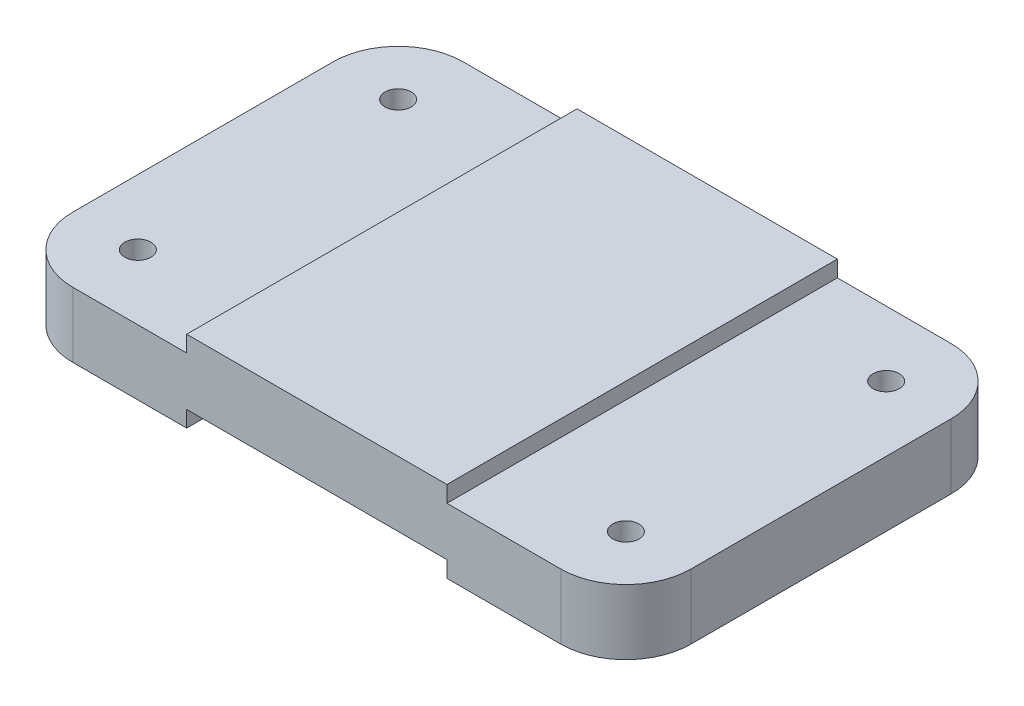
ISO-10303-21;
HEADER;
FILE_DESCRIPTION(('STEP AP214'),'2;1');
FILE_NAME('part.step','',(''),(''),'','','');
FILE_SCHEMA(('AUTOMOTIVE_DESIGN { 1 0 10303 214 1 1 1 1 }'));
ENDSEC;
DATA;
#1=APPLICATION_CONTEXT('core data for automotive mechanical design processes');
#2=APPLICATION_PROTOCOL_DEFINITION('international standard','automotive_design',2000,#1);
#3=PRODUCT_CONTEXT('',#1,'mechanical');
#4=PRODUCT('Part','Part','',(#3));
#5=PRODUCT_RELATED_PRODUCT_CATEGORY('part','',(#4));
#6=PRODUCT_DEFINITION_FORMATION('','',#4);
#7=PRODUCT_DEFINITION_CONTEXT('part definition',#1,'design');
#8=PRODUCT_DEFINITION('design','',#6,#7);
#9=PRODUCT_DEFINITION_SHAPE('','',#8);
#10=(LENGTH_UNIT() NAMED_UNIT(*) SI_UNIT(.MILLI.,.METRE.));
#11=(NAMED_UNIT(*) PLANE_ANGLE_UNIT() SI_UNIT($,.RADIAN.));
#12=(NAMED_UNIT(*) SI_UNIT($,.STERADIAN.) SOLID_ANGLE_UNIT());
#13=UNCERTAINTY_MEASURE_WITH_UNIT(LENGTH_MEASURE(1.E-05),#10,'distance_accuracy_value','');
#14=(GEOMETRIC_REPRESENTATION_CONTEXT(3) GLOBAL_UNCERTAINTY_ASSIGNED_CONTEXT((#13)) GLOBAL_UNIT_ASSIGNED_CONTEXT((#10,
#11,#12)) REPRESENTATION_CONTEXT('',''));
#15=CARTESIAN_POINT('',(0.,0.,0.));
#16=DIRECTION('',(0.,0.,1.));
#17=DIRECTION('',(1.,0.,0.));
#18=AXIS2_PLACEMENT_3D('',#15,#16,#17);
#19=CARTESIAN_POINT('',(-3.38666666666671,12.7,-76.2));
#20=DIRECTION('',(-1.,0.,0.));
#21=DIRECTION('',(0.,-1.,0.));
#22=AXIS2_PLACEMENT_3D('',#19,#20,#21);
#23=PLANE('',#22);
#24=DIRECTION('',(0.,0.,1.));
#25=VECTOR('',#24,1.);
#26=CARTESIAN_POINT('',(-3.38666666666671,12.7,-76.2));
#27=LINE('',#26,#25);
#28=CARTESIAN_POINT('',(-3.38666666666671,12.7,-63.5));
#29=VERTEX_POINT('',#28);
#30=CARTESIAN_POINT('',(-3.38666666666671,12.7,-12.7));
#31=VERTEX_POINT('',#30);
#32=EDGE_CURVE('E228',#29,#31,#27,.T.);
#33=ORIENTED_EDGE('',*,*,#32,.F.);
#34=DIRECTION('',(0.,-1.,0.));
#35=VECTOR('',#34,1.);
#36=CARTESIAN_POINT('',(-3.38666666666671,0.,-63.5));
#37=LINE('',#36,#35);
#38=CARTESIAN_POINT('',(-3.38666666666671,0.,-63.5));
#39=VERTEX_POINT('',#38);
#40=EDGE_CURVE('E271',#29,#39,#37,.T.);
#41=ORIENTED_EDGE('',*,*,#40,.T.);
#42=DIRECTION('',(0.,0.,1.));
#43=VECTOR('',#42,1.);
#44=CARTESIAN_POINT('',(-3.38666666666671,0.,-76.2));
#45=LINE('',#44,#43);
#46=CARTESIAN_POINT('',(-3.38666666666671,0.,-12.7));
#47=VERTEX_POINT('',#46);
#48=EDGE_CURVE('E171',#39,#47,#45,.T.);
#49=ORIENTED_EDGE('',*,*,#48,.T.);
#50=DIRECTION('',(0.,-1.,0.));
#51=VECTOR('',#50,1.);
#52=CARTESIAN_POINT('',(-3.38666666666671,12.7,-12.7));
#53=LINE('',#52,#51);
#54=EDGE_CURVE('E269',#47,#31,#53,.F.);
#55=ORIENTED_EDGE('',*,*,#54,.T.);
#56=EDGE_LOOP('',(#33,#41,#49,#55));
#57=FACE_BOUND('',#56,.T.);
#58=ADVANCED_FACE('F35',(#57),#23,.T.);
#59=CARTESIAN_POINT('',(31.5383333333333,12.7,-76.2));
#60=DIRECTION('',(0.,1.,0.));
#61=DIRECTION('',(-1.,0.,0.));
#62=AXIS2_PLACEMENT_3D('',#59,#60,#61);
#63=PLANE('',#62);
#64=CARTESIAN_POINT('',(9.31333333333333,12.7,-12.7));
#65=DIRECTION('',(0.,1.,0.));
#66=DIRECTION('',(0.,0.,1.));
#67=AXIS2_PLACEMENT_3D('',#64,#65,#66);
#68=CIRCLE('',#67,2.55269999999999);
#69=CARTESIAN_POINT('',(9.31333333333333,12.7,-10.1473));
#70=VERTEX_POINT('',#69);
#71=EDGE_CURVE('E401',#70,#70,#68,.T.);
#72=ORIENTED_EDGE('',*,*,#71,.F.);
#73=EDGE_LOOP('',(#72));
#74=FACE_BOUND('',#73,.T.);
#75=CARTESIAN_POINT('',(9.31333333333333,12.7,-63.5));
#76=DIRECTION('',(0.,1.,0.));
#77=DIRECTION('',(0.,0.,1.));
#78=AXIS2_PLACEMENT_3D('',#75,#76,#77);
#79=CIRCLE('',#78,2.55269999999999);
#80=CARTESIAN_POINT('',(9.31333333333333,12.7,-60.9473));
#81=VERTEX_POINT('',#80);
#82=EDGE_CURVE('E407',#81,#81,#79,.T.);
#83=ORIENTED_EDGE('',*,*,#82,.F.);
#84=EDGE_LOOP('',(#83));
#85=FACE_BOUND('',#84,.T.);
#86=DIRECTION('',(-1.,0.,0.));
#87=VECTOR('',#86,1.);
#88=CARTESIAN_POINT('',(31.5383333333333,12.7,-76.2));
#89=LINE('',#88,#87);
#90=CARTESIAN_POINT('',(31.5383333333333,12.7,-76.2));
#91=VERTEX_POINT('',#90);
#92=CARTESIAN_POINT('',(9.31333333333328,12.7,-76.2));
#93=VERTEX_POINT('',#92);
#94=EDGE_CURVE('E200',#91,#93,#89,.T.);
#95=ORIENTED_EDGE('',*,*,#94,.T.);
#96=CARTESIAN_POINT('',(9.31333333333329,12.7,-63.5));
#97=DIRECTION('',(0.,1.,0.));
#98=DIRECTION('',(-1.,0.,0.));
#99=AXIS2_PLACEMENT_3D('',#96,#97,#98);
#100=CIRCLE('',#99,12.7);
#101=EDGE_CURVE('E277',#93,#29,#100,.T.);
#102=ORIENTED_EDGE('',*,*,#101,.T.);
#103=ORIENTED_EDGE('',*,*,#32,.T.);
#104=CARTESIAN_POINT('',(9.31333333333329,12.7,-12.7));
#105=DIRECTION('',(0.,1.,0.));
#106=DIRECTION('',(-1.,0.,0.));
#107=AXIS2_PLACEMENT_3D('',#104,#105,#106);
#108=CIRCLE('',#107,12.7);
#109=CARTESIAN_POINT('',(9.31333333333328,12.7,0.));
#110=VERTEX_POINT('',#109);
#111=EDGE_CURVE('E51',#31,#110,#108,.T.);
#112=ORIENTED_EDGE('',*,*,#111,.T.);
#113=DIRECTION('',(-1.,0.,0.));
#114=VECTOR('',#113,1.);
#115=CARTESIAN_POINT('',(31.5383333333333,12.7,0.));
#116=LINE('',#115,#114);
#117=CARTESIAN_POINT('',(31.5383333333333,12.7,0.));
#118=VERTEX_POINT('',#117);
#119=EDGE_CURVE('E163',#118,#110,#116,.T.);
#120=ORIENTED_EDGE('',*,*,#119,.F.);
#121=DIRECTION('',(0.,0.,1.));
#122=VECTOR('',#121,1.);
#123=CARTESIAN_POINT('',(31.5383333333333,12.7,-76.2));
#124=LINE('',#123,#122);
#125=EDGE_CURVE('E231',#91,#118,#124,.T.);
#126=ORIENTED_EDGE('',*,*,#125,.F.);
#127=EDGE_LOOP('',(#95,#102,#103,#112,#120,#126));
#128=FACE_BOUND('',#127,.T.);
#129=ADVANCED_FACE('F304',(#74,#85,#128),#63,.T.);
#130=CARTESIAN_POINT('',(31.5383333333333,15.875,-76.2));
#131=DIRECTION('',(-1.,0.,0.));
#132=DIRECTION('',(0.,0.,1.));
#133=AXIS2_PLACEMENT_3D('',#130,#131,#132);
#134=PLANE('',#133);
#135=DIRECTION('',(0.,-1.,0.));
#136=VECTOR('',#135,1.);
#137=CARTESIAN_POINT('',(31.5383333333333,15.875,0.));
#138=LINE('',#137,#136);
#139=CARTESIAN_POINT('',(31.5383333333333,15.875,0.));
#140=VERTEX_POINT('',#139);
#141=EDGE_CURVE('E224',#140,#118,#138,.T.);
#142=ORIENTED_EDGE('',*,*,#141,.F.);
#143=DIRECTION('',(0.,0.,1.));
#144=VECTOR('',#143,1.);
#145=CARTESIAN_POINT('',(31.5383333333333,15.875,-76.2));
#146=LINE('',#145,#144);
#147=CARTESIAN_POINT('',(31.5383333333333,15.875,-76.2));
#148=VERTEX_POINT('',#147);
#149=EDGE_CURVE('E233',#148,#140,#146,.T.);
#150=ORIENTED_EDGE('',*,*,#149,.F.);
#151=DIRECTION('',(0.,-1.,0.));
#152=VECTOR('',#151,1.);
#153=CARTESIAN_POINT('',(31.5383333333333,15.875,-76.2));
#154=LINE('',#153,#152);
#155=EDGE_CURVE('E197',#148,#91,#154,.T.);
#156=ORIENTED_EDGE('',*,*,#155,.T.);
#157=ORIENTED_EDGE('',*,*,#125,.T.);
#158=EDGE_LOOP('',(#142,#150,#156,#157));
#159=FACE_BOUND('',#158,.T.);
#160=ADVANCED_FACE('F302',(#159),#134,.T.);
#161=CARTESIAN_POINT('',(82.3383333333333,15.875,-76.2));
#162=DIRECTION('',(0.,1.,0.));
#163=DIRECTION('',(-1.,0.,0.));
#164=AXIS2_PLACEMENT_3D('',#161,#162,#163);
#165=PLANE('',#164);
#166=DIRECTION('',(-1.,0.,0.));
#167=VECTOR('',#166,1.);
#168=CARTESIAN_POINT('',(82.3383333333333,15.875,0.));
#169=LINE('',#168,#167);
#170=CARTESIAN_POINT('',(82.3383333333333,15.875,0.));
#171=VERTEX_POINT('',#170);
#172=EDGE_CURVE('E221',#171,#140,#169,.T.);
#173=ORIENTED_EDGE('',*,*,#172,.F.);
#174=DIRECTION('',(0.,0.,1.));
#175=VECTOR('',#174,1.);
#176=CARTESIAN_POINT('',(82.3383333333333,15.875,-76.2));
#177=LINE('',#176,#175);
#178=CARTESIAN_POINT('',(82.3383333333333,15.875,-76.2));
#179=VERTEX_POINT('',#178);
#180=EDGE_CURVE('E235',#179,#171,#177,.T.);
#181=ORIENTED_EDGE('',*,*,#180,.F.);
#182=DIRECTION('',(-1.,0.,0.));
#183=VECTOR('',#182,1.);
#184=CARTESIAN_POINT('',(82.3383333333333,15.875,-76.2));
#185=LINE('',#184,#183);
#186=EDGE_CURVE('E194',#179,#148,#185,.T.);
#187=ORIENTED_EDGE('',*,*,#186,.T.);
#188=ORIENTED_EDGE('',*,*,#149,.T.);
#189=EDGE_LOOP('',(#173,#181,#187,#188));
#190=FACE_BOUND('',#189,.T.);
#191=ADVANCED_FACE('F298',(#190),#165,.T.);
#192=CARTESIAN_POINT('',(82.3383333333333,12.7,-76.2));
#193=DIRECTION('',(1.,0.,0.));
#194=DIRECTION('',(0.,0.,-1.));
#195=AXIS2_PLACEMENT_3D('',#192,#193,#194);
#196=PLANE('',#195);
#197=DIRECTION('',(0.,1.,0.));
#198=VECTOR('',#197,1.);
#199=CARTESIAN_POINT('',(82.3383333333333,12.7,0.));
#200=LINE('',#199,#198);
#201=CARTESIAN_POINT('',(82.3383333333333,12.7,0.));
#202=VERTEX_POINT('',#201);
#203=EDGE_CURVE('E218',#202,#171,#200,.T.);
#204=ORIENTED_EDGE('',*,*,#203,.F.);
#205=DIRECTION('',(0.,0.,1.));
#206=VECTOR('',#205,1.);
#207=CARTESIAN_POINT('',(82.3383333333333,12.7,-76.2));
#208=LINE('',#207,#206);
#209=CARTESIAN_POINT('',(82.3383333333333,12.7,-76.2));
#210=VERTEX_POINT('',#209);
#211=EDGE_CURVE('E237',#210,#202,#208,.T.);
#212=ORIENTED_EDGE('',*,*,#211,.F.);
#213=DIRECTION('',(0.,1.,0.));
#214=VECTOR('',#213,1.);
#215=CARTESIAN_POINT('',(82.3383333333333,12.7,-76.2));
#216=LINE('',#215,#214);
#217=EDGE_CURVE('E191',#210,#179,#216,.T.);
#218=ORIENTED_EDGE('',*,*,#217,.T.);
#219=ORIENTED_EDGE('',*,*,#180,.T.);
#220=EDGE_LOOP('',(#204,#212,#218,#219));
#221=FACE_BOUND('',#220,.T.);
#222=ADVANCED_FACE('F294',(#221),#196,.T.);
#223=CARTESIAN_POINT('',(117.263333333333,12.7,-76.2));
#224=DIRECTION('',(0.,1.,0.));
#225=DIRECTION('',(-1.,0.,0.));
#226=AXIS2_PLACEMENT_3D('',#223,#224,#225);
#227=PLANE('',#226);
#228=CARTESIAN_POINT('',(104.563333333333,12.7,-63.5));
#229=DIRECTION('',(0.,1.,0.));
#230=DIRECTION('',(0.,0.,1.));
#231=AXIS2_PLACEMENT_3D('',#228,#229,#230);
#232=CIRCLE('',#231,2.55269999999999);
#233=CARTESIAN_POINT('',(104.563333333333,12.7,-60.9473));
#234=VERTEX_POINT('',#233);
#235=EDGE_CURVE('E394',#234,#234,#232,.T.);
#236=ORIENTED_EDGE('',*,*,#235,.F.);
#237=EDGE_LOOP('',(#236));
#238=FACE_BOUND('',#237,.T.);
#239=CARTESIAN_POINT('',(104.563333333333,12.7,-12.7));
#240=DIRECTION('',(0.,1.,0.));
#241=DIRECTION('',(0.,0.,1.));
#242=AXIS2_PLACEMENT_3D('',#239,#240,#241);
#243=CIRCLE('',#242,2.55269999999999);
#244=CARTESIAN_POINT('',(104.563333333333,12.7,-10.1473));
#245=VERTEX_POINT('',#244);
#246=EDGE_CURVE('E396',#245,#245,#243,.T.);
#247=ORIENTED_EDGE('',*,*,#246,.F.);
#248=EDGE_LOOP('',(#247));
#249=FACE_BOUND('',#248,.T.);
#250=DIRECTION('',(0.,0.,1.));
#251=VECTOR('',#250,1.);
#252=CARTESIAN_POINT('',(117.263333333333,12.7,-76.2));
#253=LINE('',#252,#251);
#254=CARTESIAN_POINT('',(117.263333333333,12.7,-63.5));
#255=VERTEX_POINT('',#254);
#256=CARTESIAN_POINT('',(117.263333333333,12.7,-12.7));
#257=VERTEX_POINT('',#256);
#258=EDGE_CURVE('E240',#255,#257,#253,.T.);
#259=ORIENTED_EDGE('',*,*,#258,.F.);
#260=CARTESIAN_POINT('',(104.563333333333,12.7,-63.5));
#261=DIRECTION('',(0.,1.,0.));
#262=DIRECTION('',(-1.,0.,0.));
#263=AXIS2_PLACEMENT_3D('',#260,#261,#262);
#264=CIRCLE('',#263,12.7);
#265=CARTESIAN_POINT('',(104.563333333333,12.7,-76.2));
#266=VERTEX_POINT('',#265);
#267=EDGE_CURVE('E259',#255,#266,#264,.T.);
#268=ORIENTED_EDGE('',*,*,#267,.T.);
#269=DIRECTION('',(-1.,0.,0.));
#270=VECTOR('',#269,1.);
#271=CARTESIAN_POINT('',(117.263333333333,12.7,-76.2));
#272=LINE('',#271,#270);
#273=EDGE_CURVE('E189',#266,#210,#272,.T.);
#274=ORIENTED_EDGE('',*,*,#273,.T.);
#275=ORIENTED_EDGE('',*,*,#211,.T.);
#276=DIRECTION('',(-1.,0.,0.));
#277=VECTOR('',#276,1.);
#278=CARTESIAN_POINT('',(117.263333333333,12.7,0.));
#279=LINE('',#278,#277);
#280=CARTESIAN_POINT('',(104.563333333333,12.7,0.));
#281=VERTEX_POINT('',#280);
#282=EDGE_CURVE('E216',#281,#202,#279,.T.);
#283=ORIENTED_EDGE('',*,*,#282,.F.);
#284=CARTESIAN_POINT('',(104.563333333333,12.7,-12.7));
#285=DIRECTION('',(0.,1.,0.));
#286=DIRECTION('',(-1.,0.,0.));
#287=AXIS2_PLACEMENT_3D('',#284,#285,#286);
#288=CIRCLE('',#287,12.7);
#289=EDGE_CURVE('E257',#281,#257,#288,.T.);
#290=ORIENTED_EDGE('',*,*,#289,.T.);
#291=EDGE_LOOP('',(#259,#268,#274,#275,#283,#290));
#292=FACE_BOUND('',#291,.T.);
#293=ADVANCED_FACE('F289',(#238,#249,#292),#227,.T.);
#294=CARTESIAN_POINT('',(117.263333333333,0.,-76.2));
#295=DIRECTION('',(1.,0.,0.));
#296=DIRECTION('',(0.,0.,-1.));
#297=AXIS2_PLACEMENT_3D('',#294,#295,#296);
#298=PLANE('',#297);
#299=DIRECTION('',(0.,0.,1.));
#300=VECTOR('',#299,1.);
#301=CARTESIAN_POINT('',(117.263333333333,0.,-76.2));
#302=LINE('',#301,#300);
#303=CARTESIAN_POINT('',(117.263333333333,0.,-63.5));
#304=VERTEX_POINT('',#303);
#305=CARTESIAN_POINT('',(117.263333333333,0.,-12.7));
#306=VERTEX_POINT('',#305);
#307=EDGE_CURVE('E243',#304,#306,#302,.T.);
#308=ORIENTED_EDGE('',*,*,#307,.F.);
#309=DIRECTION('',(0.,1.,0.));
#310=VECTOR('',#309,1.);
#311=CARTESIAN_POINT('',(117.263333333333,12.7,-63.5));
#312=LINE('',#311,#310);
#313=EDGE_CURVE('E254',#304,#255,#312,.T.);
#314=ORIENTED_EDGE('',*,*,#313,.T.);
#315=ORIENTED_EDGE('',*,*,#258,.T.);
#316=DIRECTION('',(0.,1.,0.));
#317=VECTOR('',#316,1.);
#318=CARTESIAN_POINT('',(117.263333333333,0.,-12.7));
#319=LINE('',#318,#317);
#320=EDGE_CURVE('E230',#257,#306,#319,.F.);
#321=ORIENTED_EDGE('',*,*,#320,.T.);
#322=EDGE_LOOP('',(#308,#314,#315,#321));
#323=FACE_BOUND('',#322,.T.);
#324=ADVANCED_FACE('F324',(#323),#298,.T.);
#325=CARTESIAN_POINT('',(82.3383333333333,0.,-76.2));
#326=DIRECTION('',(0.,-1.,0.));
#327=DIRECTION('',(0.,0.,-1.));
#328=AXIS2_PLACEMENT_3D('',#325,#326,#327);
#329=PLANE('',#328);
#330=CARTESIAN_POINT('',(104.563333333333,0.,-63.5));
#331=DIRECTION('',(0.,-1.,0.));
#332=DIRECTION('',(0.,0.,-1.));
#333=AXIS2_PLACEMENT_3D('',#330,#331,#332);
#334=CIRCLE('',#333,2.55269999999999);
#335=CARTESIAN_POINT('',(104.563333333333,0.,-66.0527));
#336=VERTEX_POINT('',#335);
#337=EDGE_CURVE('E391',#336,#336,#334,.T.);
#338=ORIENTED_EDGE('',*,*,#337,.F.);
#339=EDGE_LOOP('',(#338));
#340=FACE_BOUND('',#339,.T.);
#341=CARTESIAN_POINT('',(104.563333333333,0.,-12.7));
#342=DIRECTION('',(0.,-1.,0.));
#343=DIRECTION('',(0.,0.,-1.));
#344=AXIS2_PLACEMENT_3D('',#341,#342,#343);
#345=CIRCLE('',#344,2.55269999999999);
#346=CARTESIAN_POINT('',(104.563333333333,0.,-15.2527));
#347=VERTEX_POINT('',#346);
#348=EDGE_CURVE('E39',#347,#347,#345,.T.);
#349=ORIENTED_EDGE('',*,*,#348,.F.);
#350=EDGE_LOOP('',(#349));
#351=FACE_BOUND('',#350,.T.);
#352=DIRECTION('',(1.,0.,0.));
#353=VECTOR('',#352,1.);
#354=CARTESIAN_POINT('',(82.3383333333333,0.,-76.2));
#355=LINE('',#354,#353);
#356=CARTESIAN_POINT('',(82.3383333333333,0.,-76.2));
#357=VERTEX_POINT('',#356);
#358=CARTESIAN_POINT('',(104.563333333333,0.,-76.2));
#359=VERTEX_POINT('',#358);
#360=EDGE_CURVE('E186',#357,#359,#355,.T.);
#361=ORIENTED_EDGE('',*,*,#360,.T.);
#362=CARTESIAN_POINT('',(104.563333333333,0.,-63.5));
#363=DIRECTION('',(0.,-1.,0.));
#364=DIRECTION('',(0.,0.,-1.));
#365=AXIS2_PLACEMENT_3D('',#362,#363,#364);
#366=CIRCLE('',#365,12.7);
#367=EDGE_CURVE('E267',#359,#304,#366,.T.);
#368=ORIENTED_EDGE('',*,*,#367,.T.);
#369=ORIENTED_EDGE('',*,*,#307,.T.);
#370=CARTESIAN_POINT('',(104.563333333333,0.,-12.7));
#371=DIRECTION('',(0.,-1.,0.));
#372=DIRECTION('',(0.,0.,-1.));
#373=AXIS2_PLACEMENT_3D('',#370,#371,#372);
#374=CIRCLE('',#373,12.7);
#375=CARTESIAN_POINT('',(104.563333333333,0.,0.));
#376=VERTEX_POINT('',#375);
#377=EDGE_CURVE('E265',#306,#376,#374,.T.);
#378=ORIENTED_EDGE('',*,*,#377,.T.);
#379=DIRECTION('',(1.,0.,0.));
#380=VECTOR('',#379,1.);
#381=CARTESIAN_POINT('',(82.3383333333333,0.,0.));
#382=LINE('',#381,#380);
#383=CARTESIAN_POINT('',(82.3383333333333,0.,0.));
#384=VERTEX_POINT('',#383);
#385=EDGE_CURVE('E213',#384,#376,#382,.T.);
#386=ORIENTED_EDGE('',*,*,#385,.F.);
#387=DIRECTION('',(0.,0.,1.));
#388=VECTOR('',#387,1.);
#389=CARTESIAN_POINT('',(82.3383333333333,0.,-76.2));
#390=LINE('',#389,#388);
#391=EDGE_CURVE('E246',#357,#384,#390,.T.);
#392=ORIENTED_EDGE('',*,*,#391,.F.);
#393=EDGE_LOOP('',(#361,#368,#369,#378,#386,#392));
#394=FACE_BOUND('',#393,.T.);
#395=ADVANCED_FACE('F320',(#340,#351,#394),#329,.T.);
#396=CARTESIAN_POINT('',(82.3383333333333,3.17500000000002,-76.2));
#397=DIRECTION('',(-1.,0.,0.));
#398=DIRECTION('',(0.,0.,1.));
#399=AXIS2_PLACEMENT_3D('',#396,#397,#398);
#400=PLANE('',#399);
#401=DIRECTION('',(0.,-1.,0.));
#402=VECTOR('',#401,1.);
#403=CARTESIAN_POINT('',(82.3383333333333,3.17500000000002,0.));
#404=LINE('',#403,#402);
#405=CARTESIAN_POINT('',(82.3383333333333,3.17500000000002,0.));
#406=VERTEX_POINT('',#405);
#407=EDGE_CURVE('E210',#406,#384,#404,.T.);
#408=ORIENTED_EDGE('',*,*,#407,.F.);
#409=DIRECTION('',(0.,0.,1.));
#410=VECTOR('',#409,1.);
#411=CARTESIAN_POINT('',(82.3383333333333,3.17500000000002,-76.2));
#412=LINE('',#411,#410);
#413=CARTESIAN_POINT('',(82.3383333333333,3.17500000000002,-76.2));
#414=VERTEX_POINT('',#413);
#415=EDGE_CURVE('E248',#414,#406,#412,.T.);
#416=ORIENTED_EDGE('',*,*,#415,.F.);
#417=DIRECTION('',(0.,-1.,0.));
#418=VECTOR('',#417,1.);
#419=CARTESIAN_POINT('',(82.3383333333333,3.17500000000002,-76.2));
#420=LINE('',#419,#418);
#421=EDGE_CURVE('E180',#414,#357,#420,.T.);
#422=ORIENTED_EDGE('',*,*,#421,.T.);
#423=ORIENTED_EDGE('',*,*,#391,.T.);
#424=EDGE_LOOP('',(#408,#416,#422,#423));
#425=FACE_BOUND('',#424,.T.);
#426=ADVANCED_FACE('F317',(#425),#400,.T.);
#427=CARTESIAN_POINT('',(31.5383333333333,3.175,-76.2));
#428=DIRECTION('',(0.,-1.,0.));
#429=DIRECTION('',(1.,0.,0.));
#430=AXIS2_PLACEMENT_3D('',#427,#428,#429);
#431=PLANE('',#430);
#432=DIRECTION('',(1.,0.,0.));
#433=VECTOR('',#432,1.);
#434=CARTESIAN_POINT('',(31.5383333333333,3.175,0.));
#435=LINE('',#434,#433);
#436=CARTESIAN_POINT('',(31.5383333333333,3.175,0.));
#437=VERTEX_POINT('',#436);
#438=EDGE_CURVE('E207',#437,#406,#435,.T.);
#439=ORIENTED_EDGE('',*,*,#438,.F.);
#440=DIRECTION('',(0.,0.,1.));
#441=VECTOR('',#440,1.);
#442=CARTESIAN_POINT('',(31.5383333333333,3.175,-76.2));
#443=LINE('',#442,#441);
#444=CARTESIAN_POINT('',(31.5383333333333,3.175,-76.2));
#445=VERTEX_POINT('',#444);
#446=EDGE_CURVE('E170',#445,#437,#443,.T.);
#447=ORIENTED_EDGE('',*,*,#446,.F.);
#448=DIRECTION('',(1.,0.,0.));
#449=VECTOR('',#448,1.);
#450=CARTESIAN_POINT('',(31.5383333333333,3.175,-76.2));
#451=LINE('',#450,#449);
#452=EDGE_CURVE('E178',#445,#414,#451,.T.);
#453=ORIENTED_EDGE('',*,*,#452,.T.);
#454=ORIENTED_EDGE('',*,*,#415,.T.);
#455=EDGE_LOOP('',(#439,#447,#453,#454));
#456=FACE_BOUND('',#455,.T.);
#457=ADVANCED_FACE('F315',(#456),#431,.T.);
#458=CARTESIAN_POINT('',(31.5383333333333,0.,-76.2));
#459=DIRECTION('',(1.,0.,0.));
#460=DIRECTION('',(0.,0.,-1.));
#461=AXIS2_PLACEMENT_3D('',#458,#459,#460);
#462=PLANE('',#461);
#463=DIRECTION('',(0.,1.,0.));
#464=VECTOR('',#463,1.);
#465=CARTESIAN_POINT('',(31.5383333333333,0.,0.));
#466=LINE('',#465,#464);
#467=CARTESIAN_POINT('',(31.5383333333333,0.,0.));
#468=VERTEX_POINT('',#467);
#469=EDGE_CURVE('E169',#468,#437,#466,.T.);
#470=ORIENTED_EDGE('',*,*,#469,.F.);
#471=DIRECTION('',(0.,0.,1.));
#472=VECTOR('',#471,1.);
#473=CARTESIAN_POINT('',(31.5383333333333,0.,-76.2));
#474=LINE('',#473,#472);
#475=CARTESIAN_POINT('',(31.5383333333333,0.,-76.2));
#476=VERTEX_POINT('',#475);
#477=EDGE_CURVE('E156',#476,#468,#474,.T.);
#478=ORIENTED_EDGE('',*,*,#477,.F.);
#479=DIRECTION('',(0.,1.,0.));
#480=VECTOR('',#479,1.);
#481=CARTESIAN_POINT('',(31.5383333333333,0.,-76.2));
#482=LINE('',#481,#480);
#483=EDGE_CURVE('E162',#476,#445,#482,.T.);
#484=ORIENTED_EDGE('',*,*,#483,.T.);
#485=ORIENTED_EDGE('',*,*,#446,.T.);
#486=EDGE_LOOP('',(#470,#478,#484,#485));
#487=FACE_BOUND('',#486,.T.);
#488=ADVANCED_FACE('F167',(#487),#462,.T.);
#489=CARTESIAN_POINT('',(-3.38666666666671,0.,-76.2));
#490=DIRECTION('',(0.,-1.,0.));
#491=DIRECTION('',(0.,0.,-1.));
#492=AXIS2_PLACEMENT_3D('',#489,#490,#491);
#493=PLANE('',#492);
#494=CARTESIAN_POINT('',(9.31333333333333,0.,-12.7));
#495=DIRECTION('',(0.,-1.,0.));
#496=DIRECTION('',(0.,0.,-1.));
#497=AXIS2_PLACEMENT_3D('',#494,#495,#496);
#498=CIRCLE('',#497,2.55269999999999);
#499=CARTESIAN_POINT('',(9.31333333333333,0.,-15.2527));
#500=VERTEX_POINT('',#499);
#501=EDGE_CURVE('E404',#500,#500,#498,.T.);
#502=ORIENTED_EDGE('',*,*,#501,.F.);
#503=EDGE_LOOP('',(#502));
#504=FACE_BOUND('',#503,.T.);
#505=CARTESIAN_POINT('',(9.31333333333333,0.,-63.5));
#506=DIRECTION('',(0.,-1.,0.));
#507=DIRECTION('',(0.,0.,-1.));
#508=AXIS2_PLACEMENT_3D('',#505,#506,#507);
#509=CIRCLE('',#508,2.55269999999999);
#510=CARTESIAN_POINT('',(9.31333333333333,0.,-66.0527));
#511=VERTEX_POINT('',#510);
#512=EDGE_CURVE('E205',#511,#511,#509,.T.);
#513=ORIENTED_EDGE('',*,*,#512,.F.);
#514=EDGE_LOOP('',(#513));
#515=FACE_BOUND('',#514,.T.);
#516=ORIENTED_EDGE('',*,*,#48,.F.);
#517=CARTESIAN_POINT('',(9.31333333333329,0.,-63.5));
#518=DIRECTION('',(0.,-1.,0.));
#519=DIRECTION('',(0.,0.,-1.));
#520=AXIS2_PLACEMENT_3D('',#517,#518,#519);
#521=CIRCLE('',#520,12.7);
#522=CARTESIAN_POINT('',(9.31333333333329,0.,-76.2));
#523=VERTEX_POINT('',#522);
#524=EDGE_CURVE('E158',#39,#523,#521,.T.);
#525=ORIENTED_EDGE('',*,*,#524,.T.);
#526=DIRECTION('',(1.,0.,0.));
#527=VECTOR('',#526,1.);
#528=CARTESIAN_POINT('',(-3.38666666666671,0.,-76.2));
#529=LINE('',#528,#527);
#530=EDGE_CURVE('E151',#523,#476,#529,.T.);
#531=ORIENTED_EDGE('',*,*,#530,.T.);
#532=ORIENTED_EDGE('',*,*,#477,.T.);
#533=DIRECTION('',(1.,0.,0.));
#534=VECTOR('',#533,1.);
#535=CARTESIAN_POINT('',(-3.38666666666671,0.,0.));
#536=LINE('',#535,#534);
#537=CARTESIAN_POINT('',(9.31333333333329,0.,0.));
#538=VERTEX_POINT('',#537);
#539=EDGE_CURVE('E203',#538,#468,#536,.T.);
#540=ORIENTED_EDGE('',*,*,#539,.F.);
#541=CARTESIAN_POINT('',(9.31333333333329,0.,-12.7));
#542=DIRECTION('',(0.,-1.,0.));
#543=DIRECTION('',(0.,0.,-1.));
#544=AXIS2_PLACEMENT_3D('',#541,#542,#543);
#545=CIRCLE('',#544,12.7);
#546=EDGE_CURVE('E59',#538,#47,#545,.T.);
#547=ORIENTED_EDGE('',*,*,#546,.T.);
#548=EDGE_LOOP('',(#516,#525,#531,#532,#540,#547));
#549=FACE_BOUND('',#548,.T.);
#550=ADVANCED_FACE('F154',(#504,#515,#549),#493,.T.);
#551=CARTESIAN_POINT('',(0.,0.,-76.2));
#552=DIRECTION('',(0.,0.,1.));
#553=DIRECTION('',(1.,0.,0.));
#554=AXIS2_PLACEMENT_3D('',#551,#552,#553);
#555=PLANE('',#554);
#556=ORIENTED_EDGE('',*,*,#273,.F.);
#557=DIRECTION('',(0.,1.,0.));
#558=VECTOR('',#557,1.);
#559=CARTESIAN_POINT('',(104.563333333333,0.,-76.2));
#560=LINE('',#559,#558);
#561=EDGE_CURVE('E263',#266,#359,#560,.F.);
#562=ORIENTED_EDGE('',*,*,#561,.T.);
#563=ORIENTED_EDGE('',*,*,#360,.F.);
#564=ORIENTED_EDGE('',*,*,#421,.F.);
#565=ORIENTED_EDGE('',*,*,#452,.F.);
#566=ORIENTED_EDGE('',*,*,#483,.F.);
#567=ORIENTED_EDGE('',*,*,#530,.F.);
#568=DIRECTION('',(0.,-1.,0.));
#569=VECTOR('',#568,1.);
#570=CARTESIAN_POINT('',(9.31333333333329,12.7,-76.2));
#571=LINE('',#570,#569);
#572=EDGE_CURVE('E261',#523,#93,#571,.F.);
#573=ORIENTED_EDGE('',*,*,#572,.T.);
#574=ORIENTED_EDGE('',*,*,#94,.F.);
#575=ORIENTED_EDGE('',*,*,#155,.F.);
#576=ORIENTED_EDGE('',*,*,#186,.F.);
#577=ORIENTED_EDGE('',*,*,#217,.F.);
#578=EDGE_LOOP('',(#556,#562,#563,#564,#565,#566,#567,#573,#574,#575,#576,#577));
#579=FACE_BOUND('',#578,.T.);
#580=ADVANCED_FACE('F175',(#579),#555,.F.);
#581=CARTESIAN_POINT('',(0.,0.,0.));
#582=DIRECTION('',(0.,0.,1.));
#583=DIRECTION('',(1.,0.,0.));
#584=AXIS2_PLACEMENT_3D('',#581,#582,#583);
#585=PLANE('',#584);
#586=ORIENTED_EDGE('',*,*,#119,.T.);
#587=DIRECTION('',(0.,-1.,0.));
#588=VECTOR('',#587,1.);
#589=CARTESIAN_POINT('',(9.31333333333329,0.,0.));
#590=LINE('',#589,#588);
#591=EDGE_CURVE('E11',#110,#538,#590,.T.);
#592=ORIENTED_EDGE('',*,*,#591,.T.);
#593=ORIENTED_EDGE('',*,*,#539,.T.);
#594=ORIENTED_EDGE('',*,*,#469,.T.);
#595=ORIENTED_EDGE('',*,*,#438,.T.);
#596=ORIENTED_EDGE('',*,*,#407,.T.);
#597=ORIENTED_EDGE('',*,*,#385,.T.);
#598=DIRECTION('',(0.,1.,0.));
#599=VECTOR('',#598,1.);
#600=CARTESIAN_POINT('',(104.563333333333,0.,0.));
#601=LINE('',#600,#599);
#602=EDGE_CURVE('E44',#376,#281,#601,.T.);
#603=ORIENTED_EDGE('',*,*,#602,.T.);
#604=ORIENTED_EDGE('',*,*,#282,.T.);
#605=ORIENTED_EDGE('',*,*,#203,.T.);
#606=ORIENTED_EDGE('',*,*,#172,.T.);
#607=ORIENTED_EDGE('',*,*,#141,.T.);
#608=EDGE_LOOP('',(#586,#592,#593,#594,#595,#596,#597,#603,#604,#605,#606,#607));
#609=FACE_BOUND('',#608,.T.);
#610=ADVANCED_FACE('F283',(#609),#585,.T.);
#611=CARTESIAN_POINT('',(104.563333333333,0.,-63.5));
#612=DIRECTION('',(0.,-1.,0.));
#613=DIRECTION('',(0.,0.,-1.));
#614=AXIS2_PLACEMENT_3D('',#611,#612,#613);
#615=CYLINDRICAL_SURFACE('',#614,12.7);
#616=ORIENTED_EDGE('',*,*,#367,.F.);
#617=ORIENTED_EDGE('',*,*,#561,.F.);
#618=ORIENTED_EDGE('',*,*,#267,.F.);
#619=ORIENTED_EDGE('',*,*,#313,.F.);
#620=EDGE_LOOP('',(#616,#617,#618,#619));
#621=FACE_BOUND('',#620,.T.);
#622=ADVANCED_FACE('F329',(#621),#615,.T.);
#623=CARTESIAN_POINT('',(9.31333333333329,12.7,-63.5));
#624=DIRECTION('',(0.,1.,0.));
#625=DIRECTION('',(-1.,0.,0.));
#626=AXIS2_PLACEMENT_3D('',#623,#624,#625);
#627=CYLINDRICAL_SURFACE('',#626,12.7);
#628=ORIENTED_EDGE('',*,*,#101,.F.);
#629=ORIENTED_EDGE('',*,*,#572,.F.);
#630=ORIENTED_EDGE('',*,*,#524,.F.);
#631=ORIENTED_EDGE('',*,*,#40,.F.);
#632=EDGE_LOOP('',(#628,#629,#630,#631));
#633=FACE_BOUND('',#632,.T.);
#634=ADVANCED_FACE('F311',(#633),#627,.T.);
#635=CARTESIAN_POINT('',(9.31333333333329,0.,-12.7));
#636=DIRECTION('',(0.,-1.,0.));
#637=DIRECTION('',(1.,0.,0.));
#638=AXIS2_PLACEMENT_3D('',#635,#636,#637);
#639=CYLINDRICAL_SURFACE('',#638,12.7);
#640=ORIENTED_EDGE('',*,*,#111,.F.);
#641=ORIENTED_EDGE('',*,*,#54,.F.);
#642=ORIENTED_EDGE('',*,*,#546,.F.);
#643=ORIENTED_EDGE('',*,*,#591,.F.);
#644=EDGE_LOOP('',(#640,#641,#642,#643));
#645=FACE_BOUND('',#644,.T.);
#646=ADVANCED_FACE('F306',(#645),#639,.T.);
#647=CARTESIAN_POINT('',(104.563333333333,0.,-12.7));
#648=DIRECTION('',(0.,1.,0.));
#649=DIRECTION('',(0.,0.,1.));
#650=AXIS2_PLACEMENT_3D('',#647,#648,#649);
#651=CYLINDRICAL_SURFACE('',#650,12.7);
#652=ORIENTED_EDGE('',*,*,#377,.F.);
#653=ORIENTED_EDGE('',*,*,#320,.F.);
#654=ORIENTED_EDGE('',*,*,#289,.F.);
#655=ORIENTED_EDGE('',*,*,#602,.F.);
#656=EDGE_LOOP('',(#652,#653,#654,#655));
#657=FACE_BOUND('',#656,.T.);
#658=ADVANCED_FACE('F37',(#657),#651,.T.);
#659=CARTESIAN_POINT('',(9.31333333333333,12.7,-63.5));
#660=DIRECTION('',(0.,1.,0.));
#661=DIRECTION('',(0.,0.,1.));
#662=AXIS2_PLACEMENT_3D('',#659,#660,#661);
#663=CYLINDRICAL_SURFACE('',#662,2.55269999999999);
#664=ORIENTED_EDGE('',*,*,#512,.T.);
#665=EDGE_LOOP('',(#664));
#666=FACE_BOUND('',#665,.T.);
#667=ORIENTED_EDGE('',*,*,#82,.T.);
#668=EDGE_LOOP('',(#667));
#669=FACE_BOUND('',#668,.T.);
#670=ADVANCED_FACE('F371',(#666,#669),#663,.F.);
#671=CARTESIAN_POINT('',(9.31333333333333,12.7,-12.7));
#672=DIRECTION('',(0.,1.,0.));
#673=DIRECTION('',(0.,0.,1.));
#674=AXIS2_PLACEMENT_3D('',#671,#672,#673);
#675=CYLINDRICAL_SURFACE('',#674,2.55269999999999);
#676=ORIENTED_EDGE('',*,*,#501,.T.);
#677=EDGE_LOOP('',(#676));
#678=FACE_BOUND('',#677,.T.);
#679=ORIENTED_EDGE('',*,*,#71,.T.);
#680=EDGE_LOOP('',(#679));
#681=FACE_BOUND('',#680,.T.);
#682=ADVANCED_FACE('F374',(#678,#681),#675,.F.);
#683=CARTESIAN_POINT('',(104.563333333333,12.7,-12.7));
#684=DIRECTION('',(0.,1.,0.));
#685=DIRECTION('',(0.,0.,1.));
#686=AXIS2_PLACEMENT_3D('',#683,#684,#685);
#687=CYLINDRICAL_SURFACE('',#686,2.55269999999999);
#688=ORIENTED_EDGE('',*,*,#348,.T.);
#689=EDGE_LOOP('',(#688));
#690=FACE_BOUND('',#689,.T.);
#691=ORIENTED_EDGE('',*,*,#246,.T.);
#692=EDGE_LOOP('',(#691));
#693=FACE_BOUND('',#692,.T.);
#694=ADVANCED_FACE('F378',(#690,#693),#687,.F.);
#695=CARTESIAN_POINT('',(104.563333333333,12.7,-63.5));
#696=DIRECTION('',(0.,1.,0.));
#697=DIRECTION('',(0.,0.,1.));
#698=AXIS2_PLACEMENT_3D('',#695,#696,#697);
#699=CYLINDRICAL_SURFACE('',#698,2.55269999999999);
#700=ORIENTED_EDGE('',*,*,#337,.T.);
#701=EDGE_LOOP('',(#700));
#702=FACE_BOUND('',#701,.T.);
#703=ORIENTED_EDGE('',*,*,#235,.T.);
#704=EDGE_LOOP('',(#703));
#705=FACE_BOUND('',#704,.T.);
#706=ADVANCED_FACE('F382',(#702,#705),#699,.F.);
#707=CLOSED_SHELL('',(#58,#129,#160,#191,#222,#293,#324,#395,#426,#457,#488,#550,#580,#610,#622,
#634,#646,#658,#670,#682,#694,#706));
#708=MANIFOLD_SOLID_BREP('B2',#707);
#709=ADVANCED_BREP_SHAPE_REPRESENTATION('',(#18,#708),#14);
#710=SHAPE_DEFINITION_REPRESENTATION(#9,#709);
ENDSEC;
END-ISO-10303-21;
